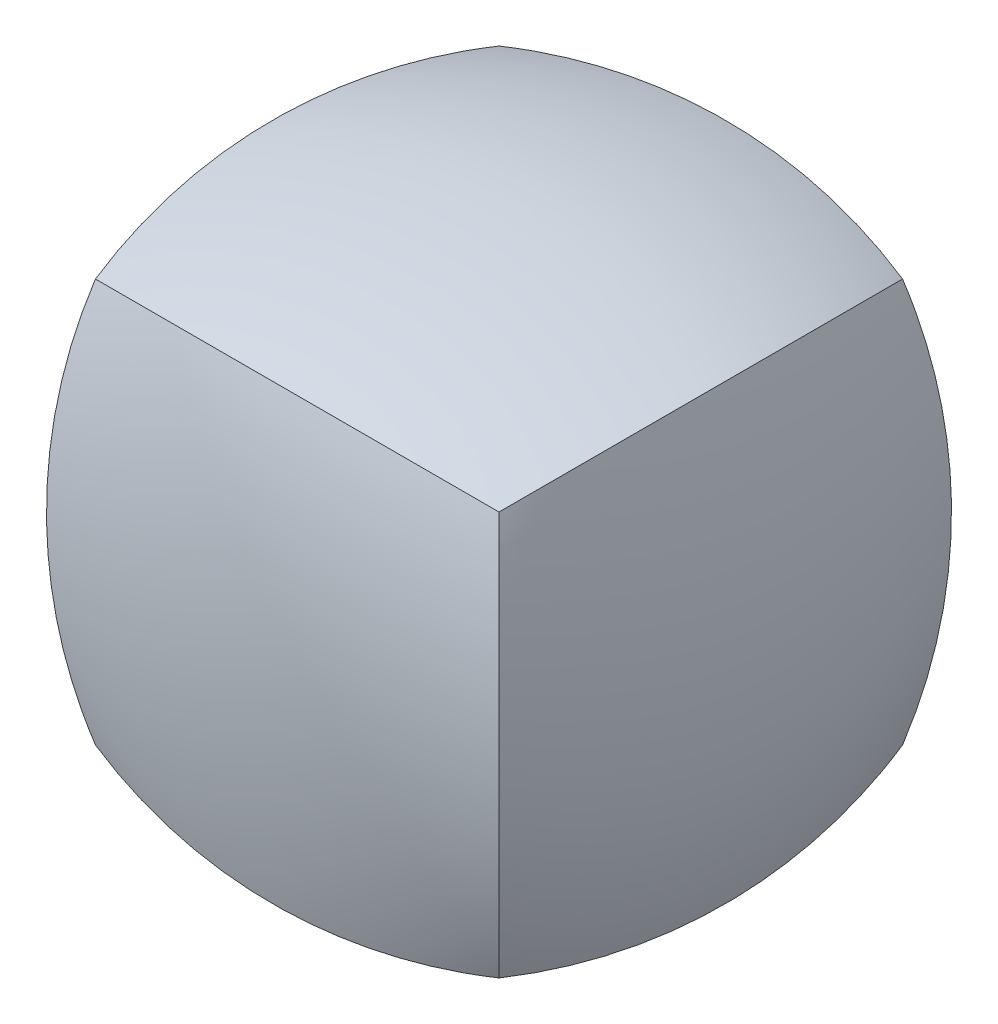
ISO-10303-21;
HEADER;
FILE_DESCRIPTION(('STEP AP214'),'2;1');
FILE_NAME('part.step','',(''),(''),'','','');
FILE_SCHEMA(('AUTOMOTIVE_DESIGN { 1 0 10303 214 1 1 1 1 }'));
ENDSEC;
DATA;
#1=APPLICATION_CONTEXT('core data for automotive mechanical design processes');
#2=APPLICATION_PROTOCOL_DEFINITION('international standard','automotive_design',2000,#1);
#3=PRODUCT_CONTEXT('',#1,'mechanical');
#4=PRODUCT('Part','Part','',(#3));
#5=PRODUCT_RELATED_PRODUCT_CATEGORY('part','',(#4));
#6=PRODUCT_DEFINITION_FORMATION('','',#4);
#7=PRODUCT_DEFINITION_CONTEXT('part definition',#1,'design');
#8=PRODUCT_DEFINITION('design','',#6,#7);
#9=PRODUCT_DEFINITION_SHAPE('','',#8);
#10=(LENGTH_UNIT() NAMED_UNIT(*) SI_UNIT(.MILLI.,.METRE.));
#11=(NAMED_UNIT(*) PLANE_ANGLE_UNIT() SI_UNIT($,.RADIAN.));
#12=(NAMED_UNIT(*) SI_UNIT($,.STERADIAN.) SOLID_ANGLE_UNIT());
#13=UNCERTAINTY_MEASURE_WITH_UNIT(LENGTH_MEASURE(1.E-05),#10,'distance_accuracy_value','');
#14=(GEOMETRIC_REPRESENTATION_CONTEXT(3) GLOBAL_UNCERTAINTY_ASSIGNED_CONTEXT((#13)) GLOBAL_UNIT_ASSIGNED_CONTEXT((#10,
#11,#12)) REPRESENTATION_CONTEXT('',''));
#15=CARTESIAN_POINT('',(0.,0.,0.));
#16=DIRECTION('',(0.,0.,1.));
#17=DIRECTION('',(1.,0.,0.));
#18=AXIS2_PLACEMENT_3D('',#15,#16,#17);
#19=CARTESIAN_POINT('',(12.7,-12.7,12.7));
#20=CARTESIAN_POINT('',(14.754265203248,-4.48293918700815,14.754265203248));
#21=CARTESIAN_POINT('',(14.754265203248,4.48293918700816,14.754265203248));
#22=CARTESIAN_POINT('',(12.7,12.7000000000007,12.6999999999992));
#23=CARTESIAN_POINT('',(4.48293918700814,-14.754265203248,14.754265203248));
#24=CARTESIAN_POINT('',(5.16769425475748,-4.89379222765603,17.2650337849986));
#25=CARTESIAN_POINT('',(5.16769425475748,5.71549830896047,17.7215371635013));
#26=CARTESIAN_POINT('',(4.48293918700817,14.7542652032488,14.754265203247));
#27=CARTESIAN_POINT('',(-4.48293918700816,-14.754265203248,14.754265203248));
#28=CARTESIAN_POINT('',(-5.16769425475746,-4.89379222765603,17.2650337849986));
#29=CARTESIAN_POINT('',(-5.16769425475746,5.71549830896047,17.7215371635013));
#30=CARTESIAN_POINT('',(-4.48293918700813,14.7542652032488,14.754265203247));
#31=CARTESIAN_POINT('',(-12.7,-12.7,12.7));
#32=CARTESIAN_POINT('',(-14.7542652032479,-4.48293918700815,14.754265203248));
#33=CARTESIAN_POINT('',(-14.7542652032479,4.48293918700816,14.754265203248));
#34=CARTESIAN_POINT('',(-12.7,12.7000000000007,12.6999999999992));
#35=B_SPLINE_SURFACE_WITH_KNOTS('',3,3,((#19,#20,#21,#22),(#23,#24,#25,#26),(#27,#28,#29,#30),
(#31,#32,#33,#34)),.UNSPECIFIED.,.F.,.F.,.F.,(4,4),(4,4),(0.,1.),(0.,0.333333333333309),.UNSPECIFIED.);
#36=CARTESIAN_POINT('',(-12.6999999999992,-12.7000000000008,12.7));
#37=CARTESIAN_POINT('',(-4.48293918700816,-14.754265203248,14.754265203248));
#38=CARTESIAN_POINT('',(4.48293918700814,-14.754265203248,14.754265203248));
#39=CARTESIAN_POINT('',(12.7000000000669,-12.6999999999393,12.7));
#40=B_SPLINE_CURVE_WITH_KNOTS('',3,(#36,#37,#38,#39),.UNSPECIFIED.,.F.,.F.,(4,4),
(0.333333333333309,0.6666666666647),.UNSPECIFIED.);
#41=CARTESIAN_POINT('',(-12.6999999999996,-12.7000000000004,12.7));
#42=VERTEX_POINT('',#41);
#43=CARTESIAN_POINT('',(12.7000000000334,-12.6999999999697,12.7));
#44=VERTEX_POINT('',#43);
#45=EDGE_CURVE('E115',#42,#44,#40,.T.);
#46=CARTESIAN_POINT('',(12.7000000000669,-12.6999999999393,12.7));
#47=CARTESIAN_POINT('',(14.754265203248,-4.48293918700815,14.754265203248));
#48=CARTESIAN_POINT('',(14.754265203248,4.48293918700816,14.754265203248));
#49=CARTESIAN_POINT('',(12.7,12.7,12.7));
#50=B_SPLINE_CURVE_WITH_KNOTS('',3,(#46,#47,#48,#49),.UNSPECIFIED.,.F.,.F.,(4,4),
(0.6666666666647,1.),.UNSPECIFIED.);
#51=CARTESIAN_POINT('',(12.7,12.7000000000004,12.6999999999996));
#52=VERTEX_POINT('',#51);
#53=EDGE_CURVE('E102',#44,#52,#50,.T.);
#54=CARTESIAN_POINT('',(12.7,12.7000000000007,12.6999999999992));
#55=CARTESIAN_POINT('',(4.48293918700817,14.7542652032488,14.754265203247));
#56=CARTESIAN_POINT('',(-4.48293918700813,14.7542652032488,14.754265203247));
#57=CARTESIAN_POINT('',(-12.7,12.7000000000007,12.6999999999992));
#58=B_SPLINE_CURVE_WITH_KNOTS('',3,(#54,#55,#56,#57),.UNSPECIFIED.,.F.,.F.,(4,4),(0.,1.),.UNSPECIFIED.);
#59=CARTESIAN_POINT('',(-12.7,12.7000000000004,12.6999999999996));
#60=VERTEX_POINT('',#59);
#61=EDGE_CURVE('E116',#52,#60,#58,.T.);
#62=CARTESIAN_POINT('',(-12.7,12.7,12.7));
#63=CARTESIAN_POINT('',(-14.7542652032479,4.48293918700816,14.754265203248));
#64=CARTESIAN_POINT('',(-14.7542652032479,-4.48293918700815,14.754265203248));
#65=CARTESIAN_POINT('',(-12.6999999999992,-12.7000000000008,12.7));
#66=B_SPLINE_CURVE_WITH_KNOTS('',3,(#62,#63,#64,#65),.UNSPECIFIED.,.F.,.F.,(4,4),(0.,
0.333333333333309),.UNSPECIFIED.);
#67=EDGE_CURVE('E113',#60,#42,#66,.T.);
#68=ORIENTED_EDGE('',*,*,#45,.T.);
#69=ORIENTED_EDGE('',*,*,#53,.T.);
#70=ORIENTED_EDGE('',*,*,#61,.T.);
#71=ORIENTED_EDGE('',*,*,#67,.T.);
#72=EDGE_LOOP('',(#68,#69,#70,#71));
#73=FACE_BOUND('',#72,.T.);
#74=ADVANCED_FACE('F61',(#73),#35,.F.);
#75=CARTESIAN_POINT('',(12.7,12.7000000000007,12.6999999999992));
#76=CARTESIAN_POINT('',(14.754265203248,14.754265203248,4.48293918700815));
#77=CARTESIAN_POINT('',(14.754265203248,14.754265203248,-4.48293918700814));
#78=CARTESIAN_POINT('',(12.7,12.6999999999393,-12.7000000000669));
#79=CARTESIAN_POINT('',(4.48293918700817,14.7542652032488,14.754265203247));
#80=CARTESIAN_POINT('',(5.16769425475747,17.630236487787,5.62419763325566));
#81=CARTESIAN_POINT('',(5.16769425475748,17.630236487783,-5.62419763326632));
#82=CARTESIAN_POINT('',(4.48293918700815,14.7542652031775,-14.7542652033257));
#83=CARTESIAN_POINT('',(-4.48293918700813,14.7542652032488,14.754265203247));
#84=CARTESIAN_POINT('',(-5.16769425475747,17.630236487787,5.62419763325566));
#85=CARTESIAN_POINT('',(-5.16769425475747,17.630236487783,-5.62419763326632));
#86=CARTESIAN_POINT('',(-4.48293918700816,14.7542652031775,-14.7542652033257));
#87=CARTESIAN_POINT('',(-12.7,12.7000000000007,12.6999999999992));
#88=CARTESIAN_POINT('',(-14.754265203248,14.754265203248,4.48293918700814));
#89=CARTESIAN_POINT('',(-14.754265203248,14.754265203248,-4.48293918700817));
#90=CARTESIAN_POINT('',(-12.7,12.6999999999393,-12.7000000000669));
#91=B_SPLINE_SURFACE_WITH_KNOTS('',3,3,((#75,#76,#77,#78),(#79,#80,#81,#82),(#83,#84,#85,#86),
(#87,#88,#89,#90)),.UNSPECIFIED.,.F.,.F.,.F.,(4,4),(4,4),(0.,1.),(0.333333333333309,
0.6666666666647),.UNSPECIFIED.);
#92=CARTESIAN_POINT('',(12.7,12.7,12.7));
#93=CARTESIAN_POINT('',(14.754265203248,14.754265203248,4.48293918700813));
#94=CARTESIAN_POINT('',(14.754265203248,14.754265203248,-4.48293918700815));
#95=CARTESIAN_POINT('',(12.7,12.7,-12.7));
#96=B_SPLINE_CURVE_WITH_KNOTS('',3,(#92,#93,#94,#95),.UNSPECIFIED.,.F.,.F.,(4,4),(0.,1.),.UNSPECIFIED.);
#97=CARTESIAN_POINT('',(12.7,12.6999999999697,-12.7000000000334));
#98=VERTEX_POINT('',#97);
#99=EDGE_CURVE('E83',#52,#98,#96,.T.);
#100=CARTESIAN_POINT('',(12.7,12.6999999999393,-12.7000000000669));
#101=CARTESIAN_POINT('',(4.48293918700815,14.7542652031775,-14.7542652033257));
#102=CARTESIAN_POINT('',(-4.48293918700816,14.7542652031775,-14.7542652033257));
#103=CARTESIAN_POINT('',(-12.7,12.6999999999393,-12.7000000000669));
#104=B_SPLINE_CURVE_WITH_KNOTS('',3,(#100,#101,#102,#103),.UNSPECIFIED.,.F.,.F.,(4,4),(0.,1.),.UNSPECIFIED.);
#105=CARTESIAN_POINT('',(-12.7,12.6999999999697,-12.7000000000334));
#106=VERTEX_POINT('',#105);
#107=EDGE_CURVE('E67',#98,#106,#104,.T.);
#108=CARTESIAN_POINT('',(-12.7,12.7,12.7));
#109=CARTESIAN_POINT('',(-14.754265203248,14.754265203248,4.48293918700812));
#110=CARTESIAN_POINT('',(-14.754265203248,14.754265203248,-4.48293918700818));
#111=CARTESIAN_POINT('',(-12.7,12.7,-12.7));
#112=B_SPLINE_CURVE_WITH_KNOTS('',3,(#108,#109,#110,#111),.UNSPECIFIED.,.F.,.F.,(4,4),(0.,1.),.UNSPECIFIED.);
#113=EDGE_CURVE('E132',#60,#106,#112,.T.);
#114=ORIENTED_EDGE('',*,*,#61,.F.);
#115=ORIENTED_EDGE('',*,*,#99,.T.);
#116=ORIENTED_EDGE('',*,*,#107,.T.);
#117=ORIENTED_EDGE('',*,*,#113,.F.);
#118=EDGE_LOOP('',(#114,#115,#116,#117));
#119=FACE_BOUND('',#118,.T.);
#120=ADVANCED_FACE('F186',(#119),#91,.F.);
#121=CARTESIAN_POINT('',(12.7,12.6999999999393,-12.7000000000669));
#122=CARTESIAN_POINT('',(14.754265203248,4.48293918700816,-14.754265203248));
#123=CARTESIAN_POINT('',(14.754265203248,-4.48293918700815,-14.754265203248));
#124=CARTESIAN_POINT('',(12.7,-12.7,-12.7));
#125=CARTESIAN_POINT('',(4.48293918700815,14.7542652031775,-14.7542652033257));
#126=CARTESIAN_POINT('',(5.16769425475747,5.71549830893975,-17.7215371635046));
#127=CARTESIAN_POINT('',(5.16769425475748,-4.89379222767597,-17.2650337849976));
#128=CARTESIAN_POINT('',(4.48293918700816,-14.754265203248,-14.754265203248));
#129=CARTESIAN_POINT('',(-4.48293918700816,14.7542652031775,-14.7542652033257));
#130=CARTESIAN_POINT('',(-5.16769425475747,5.71549830893975,-17.7215371635046));
#131=CARTESIAN_POINT('',(-5.16769425475747,-4.89379222767597,-17.2650337849976));
#132=CARTESIAN_POINT('',(-4.48293918700814,-14.754265203248,-14.754265203248));
#133=CARTESIAN_POINT('',(-12.7,12.6999999999393,-12.7000000000669));
#134=CARTESIAN_POINT('',(-14.754265203248,4.48293918700815,-14.754265203248));
#135=CARTESIAN_POINT('',(-14.7542652032479,-4.48293918700817,-14.754265203248));
#136=CARTESIAN_POINT('',(-12.7,-12.7,-12.7));
#137=B_SPLINE_SURFACE_WITH_KNOTS('',3,3,((#121,#122,#123,#124),(#125,#126,#127,#128),(#129,#130,
#131,#132),(#133,#134,#135,#136)),.UNSPECIFIED.,.F.,.F.,.F.,(4,4),(4,4),(0.,1.),
(0.6666666666647,1.),.UNSPECIFIED.);
#138=CARTESIAN_POINT('',(12.7000000000669,-12.6999999999393,-12.7));
#139=CARTESIAN_POINT('',(14.754265203248,-4.48293918700816,-14.754265203248));
#140=CARTESIAN_POINT('',(14.754265203248,4.48293918700815,-14.754265203248));
#141=CARTESIAN_POINT('',(12.7,12.7,-12.7));
#142=B_SPLINE_CURVE_WITH_KNOTS('',3,(#138,#139,#140,#141),.UNSPECIFIED.,.F.,.F.,(4,4),
(0.6666666666647,1.),.UNSPECIFIED.);
#143=CARTESIAN_POINT('',(12.7000000000335,-12.6999999999697,-12.7));
#144=VERTEX_POINT('',#143);
#145=EDGE_CURVE('E13',#144,#98,#142,.T.);
#146=CARTESIAN_POINT('',(-12.6999999999992,-12.7000000000008,-12.7));
#147=CARTESIAN_POINT('',(-4.48293918700815,-14.754265203248,-14.754265203248));
#148=CARTESIAN_POINT('',(4.48293918700816,-14.754265203248,-14.754265203248));
#149=CARTESIAN_POINT('',(12.7000000000669,-12.6999999999393,-12.7));
#150=B_SPLINE_CURVE_WITH_KNOTS('',3,(#146,#147,#148,#149),.UNSPECIFIED.,.F.,.F.,(4,4),
(0.333333333333309,0.6666666666647),.UNSPECIFIED.);
#151=CARTESIAN_POINT('',(-12.6999999999996,-12.7000000000004,-12.7));
#152=VERTEX_POINT('',#151);
#153=EDGE_CURVE('E75',#152,#144,#150,.T.);
#154=CARTESIAN_POINT('',(-12.7,12.7,-12.7));
#155=CARTESIAN_POINT('',(-14.7542652032479,4.48293918700814,-14.754265203248));
#156=CARTESIAN_POINT('',(-14.7542652032479,-4.48293918700817,-14.754265203248));
#157=CARTESIAN_POINT('',(-12.6999999999992,-12.7000000000008,-12.7));
#158=B_SPLINE_CURVE_WITH_KNOTS('',3,(#154,#155,#156,#157),.UNSPECIFIED.,.F.,.F.,(4,4),(0.,
0.333333333333309),.UNSPECIFIED.);
#159=EDGE_CURVE('E107',#106,#152,#158,.T.);
#160=ORIENTED_EDGE('',*,*,#107,.F.);
#161=ORIENTED_EDGE('',*,*,#145,.F.);
#162=ORIENTED_EDGE('',*,*,#153,.F.);
#163=ORIENTED_EDGE('',*,*,#159,.F.);
#164=EDGE_LOOP('',(#160,#161,#162,#163));
#165=FACE_BOUND('',#164,.T.);
#166=ADVANCED_FACE('F63',(#165),#137,.F.);
#167=CARTESIAN_POINT('',(-12.7,12.7,12.7));
#168=CARTESIAN_POINT('',(-14.7542652032479,4.48293918700816,14.754265203248));
#169=CARTESIAN_POINT('',(-14.7542652032479,-4.48293918700815,14.754265203248));
#170=CARTESIAN_POINT('',(-12.6999999999992,-12.7000000000008,12.7));
#171=CARTESIAN_POINT('',(-14.754265203248,14.754265203248,4.48293918700812));
#172=CARTESIAN_POINT('',(-17.2650337849986,4.89379222765604,5.16769425475747));
#173=CARTESIAN_POINT('',(-17.7215371635013,-5.71549830896047,5.16769425475747));
#174=CARTESIAN_POINT('',(-14.754265203247,-14.7542652032489,4.48293918700816));
#175=CARTESIAN_POINT('',(-14.754265203248,14.754265203248,-4.48293918700818));
#176=CARTESIAN_POINT('',(-17.2650337849986,4.89379222765603,-5.16769425475749));
#177=CARTESIAN_POINT('',(-17.7215371635013,-5.71549830896048,-5.16769425475749));
#178=CARTESIAN_POINT('',(-14.754265203247,-14.7542652032489,-4.48293918700814));
#179=CARTESIAN_POINT('',(-12.7,12.7,-12.7));
#180=CARTESIAN_POINT('',(-14.7542652032479,4.48293918700814,-14.754265203248));
#181=CARTESIAN_POINT('',(-14.7542652032479,-4.48293918700817,-14.754265203248));
#182=CARTESIAN_POINT('',(-12.6999999999992,-12.7000000000008,-12.7));
#183=B_SPLINE_SURFACE_WITH_KNOTS('',3,3,((#167,#168,#169,#170),(#171,#172,#173,#174),(#175,#176,
#177,#178),(#179,#180,#181,#182)),.UNSPECIFIED.,.F.,.F.,.F.,(4,4),(4,4),(0.,1.),(0.,
0.333333333333309),.UNSPECIFIED.);
#184=CARTESIAN_POINT('',(-12.6999999999992,-12.7000000000008,12.7));
#185=CARTESIAN_POINT('',(-14.754265203247,-14.7542652032489,4.48293918700816));
#186=CARTESIAN_POINT('',(-14.754265203247,-14.7542652032489,-4.48293918700814));
#187=CARTESIAN_POINT('',(-12.6999999999992,-12.7000000000008,-12.7));
#188=B_SPLINE_CURVE_WITH_KNOTS('',3,(#184,#185,#186,#187),.UNSPECIFIED.,.F.,.F.,(4,4),(0.,1.),.UNSPECIFIED.);
#189=EDGE_CURVE('E126',#42,#152,#188,.T.);
#190=ORIENTED_EDGE('',*,*,#113,.T.);
#191=ORIENTED_EDGE('',*,*,#159,.T.);
#192=ORIENTED_EDGE('',*,*,#189,.F.);
#193=ORIENTED_EDGE('',*,*,#67,.F.);
#194=EDGE_LOOP('',(#190,#191,#192,#193));
#195=FACE_BOUND('',#194,.T.);
#196=ADVANCED_FACE('F131',(#195),#183,.T.);
#197=CARTESIAN_POINT('',(-12.6999999999992,-12.7000000000008,12.7));
#198=CARTESIAN_POINT('',(-4.48293918700816,-14.754265203248,14.754265203248));
#199=CARTESIAN_POINT('',(4.48293918700814,-14.754265203248,14.754265203248));
#200=CARTESIAN_POINT('',(12.7000000000669,-12.6999999999393,12.7));
#201=CARTESIAN_POINT('',(-14.754265203247,-14.7542652032489,4.48293918700816));
#202=CARTESIAN_POINT('',(-5.62419763325566,-17.630236487787,5.16769425475747));
#203=CARTESIAN_POINT('',(5.62419763326631,-17.630236487783,5.16769425475748));
#204=CARTESIAN_POINT('',(14.7542652033257,-14.7542652031775,4.48293918700816));
#205=CARTESIAN_POINT('',(-14.754265203247,-14.7542652032489,-4.48293918700814));
#206=CARTESIAN_POINT('',(-5.62419763325566,-17.630236487787,-5.16769425475748));
#207=CARTESIAN_POINT('',(5.62419763326632,-17.630236487783,-5.16769425475748));
#208=CARTESIAN_POINT('',(14.7542652033257,-14.7542652031775,-4.48293918700814));
#209=CARTESIAN_POINT('',(-12.6999999999992,-12.7000000000008,-12.7));
#210=CARTESIAN_POINT('',(-4.48293918700815,-14.754265203248,-14.754265203248));
#211=CARTESIAN_POINT('',(4.48293918700816,-14.754265203248,-14.754265203248));
#212=CARTESIAN_POINT('',(12.7000000000669,-12.6999999999393,-12.7));
#213=B_SPLINE_SURFACE_WITH_KNOTS('',3,3,((#197,#198,#199,#200),(#201,#202,#203,#204),(#205,#206,
#207,#208),(#209,#210,#211,#212)),.UNSPECIFIED.,.F.,.F.,.F.,(4,4),(4,4),(0.,1.),
(0.333333333333309,0.6666666666647),.UNSPECIFIED.);
#214=CARTESIAN_POINT('',(12.7000000000669,-12.6999999999393,12.7));
#215=CARTESIAN_POINT('',(14.7542652033257,-14.7542652031775,4.48293918700816));
#216=CARTESIAN_POINT('',(14.7542652033257,-14.7542652031775,-4.48293918700814));
#217=CARTESIAN_POINT('',(12.7000000000669,-12.6999999999393,-12.7));
#218=B_SPLINE_CURVE_WITH_KNOTS('',3,(#214,#215,#216,#217),.UNSPECIFIED.,.F.,.F.,(4,4),(0.,1.),.UNSPECIFIED.);
#219=EDGE_CURVE('E128',#44,#144,#218,.T.);
#220=ORIENTED_EDGE('',*,*,#189,.T.);
#221=ORIENTED_EDGE('',*,*,#153,.T.);
#222=ORIENTED_EDGE('',*,*,#219,.F.);
#223=ORIENTED_EDGE('',*,*,#45,.F.);
#224=EDGE_LOOP('',(#220,#221,#222,#223));
#225=FACE_BOUND('',#224,.T.);
#226=ADVANCED_FACE('F125',(#225),#213,.T.);
#227=CARTESIAN_POINT('',(12.7000000000669,-12.6999999999393,12.7));
#228=CARTESIAN_POINT('',(14.754265203248,-4.48293918700815,14.754265203248));
#229=CARTESIAN_POINT('',(14.754265203248,4.48293918700816,14.754265203248));
#230=CARTESIAN_POINT('',(12.7,12.7,12.7));
#231=CARTESIAN_POINT('',(14.7542652033257,-14.7542652031775,4.48293918700816));
#232=CARTESIAN_POINT('',(17.7215371635046,-5.71549830893975,5.16769425475747));
#233=CARTESIAN_POINT('',(17.2650337849976,4.89379222767597,5.16769425475747));
#234=CARTESIAN_POINT('',(14.754265203248,14.754265203248,4.48293918700813));
#235=CARTESIAN_POINT('',(14.7542652033257,-14.7542652031775,-4.48293918700814));
#236=CARTESIAN_POINT('',(17.7215371635046,-5.71549830893975,-5.16769425475748));
#237=CARTESIAN_POINT('',(17.2650337849976,4.89379222767597,-5.16769425475748));
#238=CARTESIAN_POINT('',(14.754265203248,14.754265203248,-4.48293918700815));
#239=CARTESIAN_POINT('',(12.7000000000669,-12.6999999999393,-12.7));
#240=CARTESIAN_POINT('',(14.754265203248,-4.48293918700816,-14.754265203248));
#241=CARTESIAN_POINT('',(14.754265203248,4.48293918700815,-14.754265203248));
#242=CARTESIAN_POINT('',(12.7,12.7,-12.7));
#243=B_SPLINE_SURFACE_WITH_KNOTS('',3,3,((#227,#228,#229,#230),(#231,#232,#233,#234),(#235,#236,
#237,#238),(#239,#240,#241,#242)),.UNSPECIFIED.,.F.,.F.,.F.,(4,4),(4,4),(0.,1.),
(0.6666666666647,1.),.UNSPECIFIED.);
#244=ORIENTED_EDGE('',*,*,#219,.T.);
#245=ORIENTED_EDGE('',*,*,#145,.T.);
#246=ORIENTED_EDGE('',*,*,#99,.F.);
#247=ORIENTED_EDGE('',*,*,#53,.F.);
#248=EDGE_LOOP('',(#244,#245,#246,#247));
#249=FACE_BOUND('',#248,.T.);
#250=ADVANCED_FACE('F188',(#249),#243,.T.);
#251=CLOSED_SHELL('',(#74,#120,#166,#196,#226,#250));
#252=MANIFOLD_SOLID_BREP('B2',#251);
#253=ADVANCED_BREP_SHAPE_REPRESENTATION('',(#18,#252),#14);
#254=SHAPE_DEFINITION_REPRESENTATION(#9,#253);
ENDSEC;
END-ISO-10303-21;
